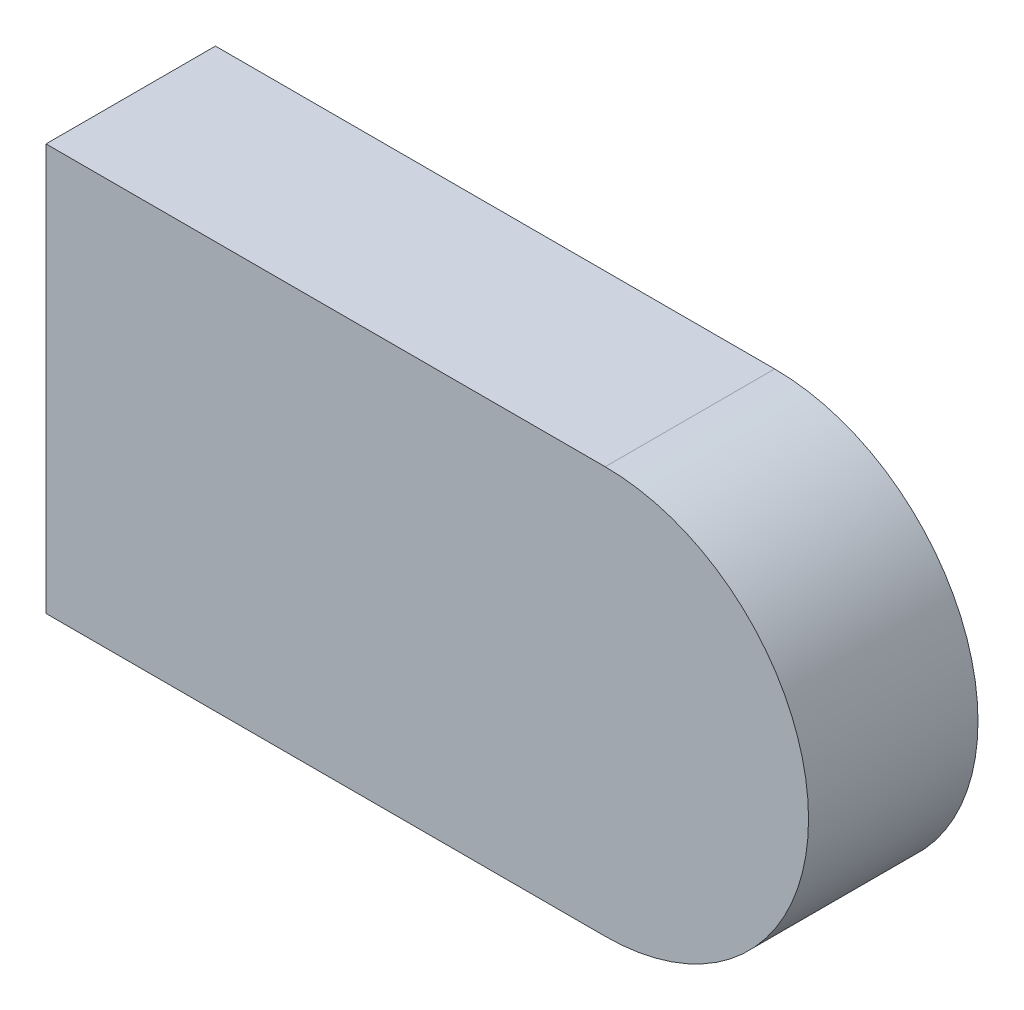
ISO-10303-21;
HEADER;
FILE_DESCRIPTION(('STEP AP214'),'2;1');
FILE_NAME('part.step','',(''),(''),'','','');
FILE_SCHEMA(('AUTOMOTIVE_DESIGN { 1 0 10303 214 1 1 1 1 }'));
ENDSEC;
DATA;
#1=APPLICATION_CONTEXT('core data for automotive mechanical design processes');
#2=APPLICATION_PROTOCOL_DEFINITION('international standard','automotive_design',2000,#1);
#3=PRODUCT_CONTEXT('',#1,'mechanical');
#4=PRODUCT('Part','Part','',(#3));
#5=PRODUCT_RELATED_PRODUCT_CATEGORY('part','',(#4));
#6=PRODUCT_DEFINITION_FORMATION('','',#4);
#7=PRODUCT_DEFINITION_CONTEXT('part definition',#1,'design');
#8=PRODUCT_DEFINITION('design','',#6,#7);
#9=PRODUCT_DEFINITION_SHAPE('','',#8);
#10=(LENGTH_UNIT() NAMED_UNIT(*) SI_UNIT(.MILLI.,.METRE.));
#11=(NAMED_UNIT(*) PLANE_ANGLE_UNIT() SI_UNIT($,.RADIAN.));
#12=(NAMED_UNIT(*) SI_UNIT($,.STERADIAN.) SOLID_ANGLE_UNIT());
#13=UNCERTAINTY_MEASURE_WITH_UNIT(LENGTH_MEASURE(1.E-05),#10,'distance_accuracy_value','');
#14=(GEOMETRIC_REPRESENTATION_CONTEXT(3) GLOBAL_UNCERTAINTY_ASSIGNED_CONTEXT((#13)) GLOBAL_UNIT_ASSIGNED_CONTEXT((#10,
#11,#12)) REPRESENTATION_CONTEXT('',''));
#15=CARTESIAN_POINT('',(0.,0.,0.));
#16=DIRECTION('',(0.,0.,1.));
#17=DIRECTION('',(1.,0.,0.));
#18=AXIS2_PLACEMENT_3D('',#15,#16,#17);
#19=CARTESIAN_POINT('',(-4.05,0.13,0.));
#20=DIRECTION('',(0.,1.,0.));
#21=DIRECTION('',(1.,0.,0.));
#22=AXIS2_PLACEMENT_3D('',#19,#20,#21);
#23=PLANE('',#22);
#24=DIRECTION('',(1.,0.,0.));
#25=VECTOR('',#24,1.);
#26=CARTESIAN_POINT('',(-4.05,0.13,0.));
#27=LINE('',#26,#25);
#28=CARTESIAN_POINT('',(-4.05,0.13,0.));
#29=VERTEX_POINT('',#28);
#30=CARTESIAN_POINT('',(-3.72,0.13,0.));
#31=VERTEX_POINT('',#30);
#32=EDGE_CURVE('E11',#29,#31,#27,.T.);
#33=ORIENTED_EDGE('',*,*,#32,.T.);
#34=DIRECTION('',(0.,0.,1.));
#35=VECTOR('',#34,1.);
#36=CARTESIAN_POINT('',(-3.72,0.13,0.));
#37=LINE('',#36,#35);
#38=CARTESIAN_POINT('',(-3.72,0.13,0.1));
#39=VERTEX_POINT('',#38);
#40=EDGE_CURVE('E24',#31,#39,#37,.T.);
#41=ORIENTED_EDGE('',*,*,#40,.T.);
#42=DIRECTION('',(1.,0.,0.));
#43=VECTOR('',#42,1.);
#44=CARTESIAN_POINT('',(-4.05,0.13,0.1));
#45=LINE('',#44,#43);
#46=CARTESIAN_POINT('',(-4.05,0.13,0.1));
#47=VERTEX_POINT('',#46);
#48=EDGE_CURVE('E88',#47,#39,#45,.T.);
#49=ORIENTED_EDGE('',*,*,#48,.F.);
#50=DIRECTION('',(0.,0.,1.));
#51=VECTOR('',#50,1.);
#52=CARTESIAN_POINT('',(-4.05,0.13,0.));
#53=LINE('',#52,#51);
#54=EDGE_CURVE('E36',#29,#47,#53,.T.);
#55=ORIENTED_EDGE('',*,*,#54,.F.);
#56=EDGE_LOOP('',(#33,#41,#49,#55));
#57=FACE_BOUND('',#56,.T.);
#58=ADVANCED_FACE('F17',(#57),#23,.F.);
#59=CARTESIAN_POINT('',(-3.72,0.25,0.));
#60=DIRECTION('',(0.,0.,-1.));
#61=DIRECTION('',(1.,0.,0.));
#62=AXIS2_PLACEMENT_3D('',#59,#60,#61);
#63=CYLINDRICAL_SURFACE('',#62,0.12);
#64=CARTESIAN_POINT('',(-3.72,0.25,0.));
#65=DIRECTION('',(0.,0.,1.));
#66=DIRECTION('',(1.,0.,0.));
#67=AXIS2_PLACEMENT_3D('',#64,#65,#66);
#68=CIRCLE('',#67,0.12);
#69=CARTESIAN_POINT('',(-3.72,0.37,0.));
#70=VERTEX_POINT('',#69);
#71=EDGE_CURVE('E85',#31,#70,#68,.T.);
#72=ORIENTED_EDGE('',*,*,#71,.T.);
#73=DIRECTION('',(0.,0.,1.));
#74=VECTOR('',#73,1.);
#75=CARTESIAN_POINT('',(-3.72,0.37,0.));
#76=LINE('',#75,#74);
#77=CARTESIAN_POINT('',(-3.72,0.37,0.1));
#78=VERTEX_POINT('',#77);
#79=EDGE_CURVE('E73',#70,#78,#76,.T.);
#80=ORIENTED_EDGE('',*,*,#79,.T.);
#81=CARTESIAN_POINT('',(-3.72,0.25,0.1));
#82=DIRECTION('',(0.,0.,1.));
#83=DIRECTION('',(1.,0.,0.));
#84=AXIS2_PLACEMENT_3D('',#81,#82,#83);
#85=CIRCLE('',#84,0.12);
#86=EDGE_CURVE('E66',#39,#78,#85,.T.);
#87=ORIENTED_EDGE('',*,*,#86,.F.);
#88=ORIENTED_EDGE('',*,*,#40,.F.);
#89=EDGE_LOOP('',(#72,#80,#87,#88));
#90=FACE_BOUND('',#89,.T.);
#91=ADVANCED_FACE('F89',(#90),#63,.T.);
#92=CARTESIAN_POINT('',(-4.05,0.37,0.));
#93=DIRECTION('',(0.,1.,0.));
#94=DIRECTION('',(1.,0.,0.));
#95=AXIS2_PLACEMENT_3D('',#92,#93,#94);
#96=PLANE('',#95);
#97=DIRECTION('',(0.,0.,1.));
#98=VECTOR('',#97,1.);
#99=CARTESIAN_POINT('',(-4.05,0.37,0.));
#100=LINE('',#99,#98);
#101=CARTESIAN_POINT('',(-4.05,0.37,0.));
#102=VERTEX_POINT('',#101);
#103=CARTESIAN_POINT('',(-4.05,0.37,0.1));
#104=VERTEX_POINT('',#103);
#105=EDGE_CURVE('E56',#102,#104,#100,.T.);
#106=ORIENTED_EDGE('',*,*,#105,.T.);
#107=DIRECTION('',(1.,0.,0.));
#108=VECTOR('',#107,1.);
#109=CARTESIAN_POINT('',(-4.05,0.37,0.1));
#110=LINE('',#109,#108);
#111=EDGE_CURVE('E67',#104,#78,#110,.T.);
#112=ORIENTED_EDGE('',*,*,#111,.T.);
#113=ORIENTED_EDGE('',*,*,#79,.F.);
#114=DIRECTION('',(1.,0.,0.));
#115=VECTOR('',#114,1.);
#116=CARTESIAN_POINT('',(-4.05,0.37,0.));
#117=LINE('',#116,#115);
#118=EDGE_CURVE('E71',#102,#70,#117,.T.);
#119=ORIENTED_EDGE('',*,*,#118,.F.);
#120=EDGE_LOOP('',(#106,#112,#113,#119));
#121=FACE_BOUND('',#120,.T.);
#122=ADVANCED_FACE('F72',(#121),#96,.T.);
#123=CARTESIAN_POINT('',(-4.05,0.13,0.));
#124=DIRECTION('',(-1.,0.,0.));
#125=DIRECTION('',(0.,1.,0.));
#126=AXIS2_PLACEMENT_3D('',#123,#124,#125);
#127=PLANE('',#126);
#128=ORIENTED_EDGE('',*,*,#54,.T.);
#129=DIRECTION('',(0.,1.,0.));
#130=VECTOR('',#129,1.);
#131=CARTESIAN_POINT('',(-4.05,0.13,0.1));
#132=LINE('',#131,#130);
#133=EDGE_CURVE('E62',#47,#104,#132,.T.);
#134=ORIENTED_EDGE('',*,*,#133,.T.);
#135=ORIENTED_EDGE('',*,*,#105,.F.);
#136=DIRECTION('',(0.,1.,0.));
#137=VECTOR('',#136,1.);
#138=CARTESIAN_POINT('',(-4.05,0.13,0.));
#139=LINE('',#138,#137);
#140=EDGE_CURVE('E60',#29,#102,#139,.T.);
#141=ORIENTED_EDGE('',*,*,#140,.F.);
#142=EDGE_LOOP('',(#128,#134,#135,#141));
#143=FACE_BOUND('',#142,.T.);
#144=ADVANCED_FACE('F58',(#143),#127,.T.);
#145=CARTESIAN_POINT('',(-3.849490847913,0.25,0.));
#146=DIRECTION('',(0.,0.,1.));
#147=DIRECTION('',(1.,0.,0.));
#148=AXIS2_PLACEMENT_3D('',#145,#146,#147);
#149=PLANE('',#148);
#150=ORIENTED_EDGE('',*,*,#140,.T.);
#151=ORIENTED_EDGE('',*,*,#118,.T.);
#152=ORIENTED_EDGE('',*,*,#71,.F.);
#153=ORIENTED_EDGE('',*,*,#32,.F.);
#154=EDGE_LOOP('',(#150,#151,#152,#153));
#155=FACE_BOUND('',#154,.T.);
#156=ADVANCED_FACE('F77',(#155),#149,.F.);
#157=CARTESIAN_POINT('',(-3.849490847913,0.25,0.1));
#158=DIRECTION('',(0.,0.,1.));
#159=DIRECTION('',(1.,0.,0.));
#160=AXIS2_PLACEMENT_3D('',#157,#158,#159);
#161=PLANE('',#160);
#162=ORIENTED_EDGE('',*,*,#48,.T.);
#163=ORIENTED_EDGE('',*,*,#86,.T.);
#164=ORIENTED_EDGE('',*,*,#111,.F.);
#165=ORIENTED_EDGE('',*,*,#133,.F.);
#166=EDGE_LOOP('',(#162,#163,#164,#165));
#167=FACE_BOUND('',#166,.T.);
#168=ADVANCED_FACE('F91',(#167),#161,.T.);
#169=CLOSED_SHELL('',(#58,#91,#122,#144,#156,#168));
#170=MANIFOLD_SOLID_BREP('B1',#169);
#171=ADVANCED_BREP_SHAPE_REPRESENTATION('',(#18,#170),#14);
#172=SHAPE_DEFINITION_REPRESENTATION(#9,#171);
ENDSEC;
END-ISO-10303-21;
